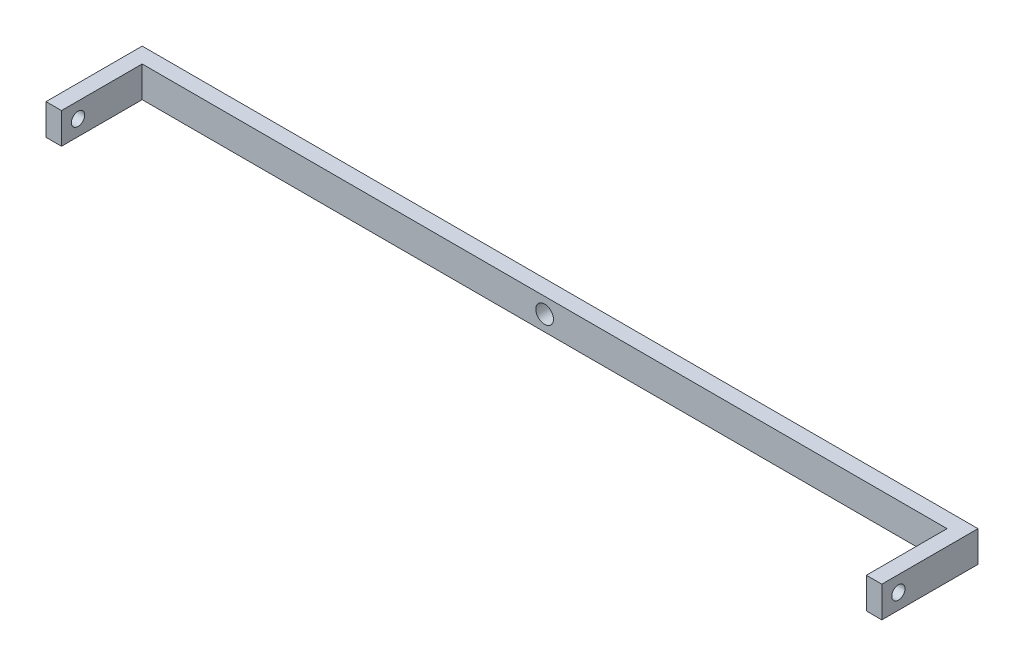
ISO-10303-21;
HEADER;
FILE_DESCRIPTION(('STEP AP214'),'2;1');
FILE_NAME('part.step','',(''),(''),'','','');
FILE_SCHEMA(('AUTOMOTIVE_DESIGN { 1 0 10303 214 1 1 1 1 }'));
ENDSEC;
DATA;
#1=APPLICATION_CONTEXT('core data for automotive mechanical design processes');
#2=APPLICATION_PROTOCOL_DEFINITION('international standard','automotive_design',2000,#1);
#3=PRODUCT_CONTEXT('',#1,'mechanical');
#4=PRODUCT('Part','Part','',(#3));
#5=PRODUCT_RELATED_PRODUCT_CATEGORY('part','',(#4));
#6=PRODUCT_DEFINITION_FORMATION('','',#4);
#7=PRODUCT_DEFINITION_CONTEXT('part definition',#1,'design');
#8=PRODUCT_DEFINITION('design','',#6,#7);
#9=PRODUCT_DEFINITION_SHAPE('','',#8);
#10=(LENGTH_UNIT() NAMED_UNIT(*) SI_UNIT(.MILLI.,.METRE.));
#11=(NAMED_UNIT(*) PLANE_ANGLE_UNIT() SI_UNIT($,.RADIAN.));
#12=(NAMED_UNIT(*) SI_UNIT($,.STERADIAN.) SOLID_ANGLE_UNIT());
#13=UNCERTAINTY_MEASURE_WITH_UNIT(LENGTH_MEASURE(1.E-05),#10,'distance_accuracy_value','');
#14=(GEOMETRIC_REPRESENTATION_CONTEXT(3) GLOBAL_UNCERTAINTY_ASSIGNED_CONTEXT((#13)) GLOBAL_UNIT_ASSIGNED_CONTEXT((#10,
#11,#12)) REPRESENTATION_CONTEXT('',''));
#15=CARTESIAN_POINT('',(0.,0.,0.));
#16=DIRECTION('',(0.,0.,1.));
#17=DIRECTION('',(1.,0.,0.));
#18=AXIS2_PLACEMENT_3D('',#15,#16,#17);
#19=CARTESIAN_POINT('',(94.5,3.5,-1.75));
#20=DIRECTION('',(0.,0.,1.));
#21=DIRECTION('',(1.,0.,0.));
#22=AXIS2_PLACEMENT_3D('',#19,#20,#21);
#23=PLANE('',#22);
#24=CARTESIAN_POINT('',(0.,0.,-1.74999999999999));
#25=DIRECTION('',(0.,0.,-1.));
#26=DIRECTION('',(-1.,0.,0.));
#27=AXIS2_PLACEMENT_3D('',#24,#25,#26);
#28=CIRCLE('',#27,2.);
#29=CARTESIAN_POINT('',(-2.,0.,-1.74999999999999));
#30=VERTEX_POINT('',#29);
#31=EDGE_CURVE('E179',#30,#30,#28,.T.);
#32=ORIENTED_EDGE('',*,*,#31,.F.);
#33=EDGE_LOOP('',(#32));
#34=FACE_BOUND('',#33,.T.);
#35=DIRECTION('',(-1.,0.,0.));
#36=VECTOR('',#35,1.);
#37=CARTESIAN_POINT('',(94.5,-3.5,-1.75));
#38=LINE('',#37,#36);
#39=CARTESIAN_POINT('',(94.5,-3.5,-1.75));
#40=VERTEX_POINT('',#39);
#41=CARTESIAN_POINT('',(-94.5,-3.5,-1.74999999999998));
#42=VERTEX_POINT('',#41);
#43=EDGE_CURVE('E131',#40,#42,#38,.T.);
#44=ORIENTED_EDGE('',*,*,#43,.T.);
#45=DIRECTION('',(0.,-1.,0.));
#46=VECTOR('',#45,1.);
#47=CARTESIAN_POINT('',(-94.5,3.5,-1.74999999999998));
#48=LINE('',#47,#46);
#49=CARTESIAN_POINT('',(-94.5,3.5,-1.74999999999998));
#50=VERTEX_POINT('',#49);
#51=EDGE_CURVE('E11',#50,#42,#48,.T.);
#52=ORIENTED_EDGE('',*,*,#51,.F.);
#53=DIRECTION('',(-1.,0.,0.));
#54=VECTOR('',#53,1.);
#55=CARTESIAN_POINT('',(94.5,3.5,-1.75));
#56=LINE('',#55,#54);
#57=CARTESIAN_POINT('',(94.5,3.5,-1.75));
#58=VERTEX_POINT('',#57);
#59=EDGE_CURVE('E145',#58,#50,#56,.T.);
#60=ORIENTED_EDGE('',*,*,#59,.F.);
#61=DIRECTION('',(0.,-1.,0.));
#62=VECTOR('',#61,1.);
#63=CARTESIAN_POINT('',(94.5,3.5,-1.75));
#64=LINE('',#63,#62);
#65=EDGE_CURVE('E127',#58,#40,#64,.T.);
#66=ORIENTED_EDGE('',*,*,#65,.T.);
#67=EDGE_LOOP('',(#44,#52,#60,#66));
#68=FACE_BOUND('',#67,.T.);
#69=ADVANCED_FACE('F34',(#34,#68),#23,.F.);
#70=CARTESIAN_POINT('',(-94.5,3.5,-1.74999999999998));
#71=DIRECTION('',(1.,0.,0.));
#72=DIRECTION('',(0.,0.,-1.));
#73=AXIS2_PLACEMENT_3D('',#70,#71,#72);
#74=PLANE('',#73);
#75=CARTESIAN_POINT('',(-94.5,0.,16.25));
#76=DIRECTION('',(1.,0.,0.));
#77=DIRECTION('',(0.,0.,-1.));
#78=AXIS2_PLACEMENT_3D('',#75,#76,#77);
#79=CIRCLE('',#78,1.5);
#80=CARTESIAN_POINT('',(-94.5,0.,14.75));
#81=VERTEX_POINT('',#80);
#82=EDGE_CURVE('E182',#81,#81,#79,.T.);
#83=ORIENTED_EDGE('',*,*,#82,.T.);
#84=EDGE_LOOP('',(#83));
#85=FACE_BOUND('',#84,.T.);
#86=DIRECTION('',(0.,0.,1.));
#87=VECTOR('',#86,1.);
#88=CARTESIAN_POINT('',(-94.5,-3.5,-1.74999999999998));
#89=LINE('',#88,#87);
#90=CARTESIAN_POINT('',(-94.5,-3.5,20.));
#91=VERTEX_POINT('',#90);
#92=EDGE_CURVE('E134',#42,#91,#89,.T.);
#93=ORIENTED_EDGE('',*,*,#92,.T.);
#94=DIRECTION('',(0.,-1.,0.));
#95=VECTOR('',#94,1.);
#96=CARTESIAN_POINT('',(-94.5,3.5,20.));
#97=LINE('',#96,#95);
#98=CARTESIAN_POINT('',(-94.5,3.5,20.));
#99=VERTEX_POINT('',#98);
#100=EDGE_CURVE('E43',#99,#91,#97,.T.);
#101=ORIENTED_EDGE('',*,*,#100,.F.);
#102=DIRECTION('',(0.,0.,1.));
#103=VECTOR('',#102,1.);
#104=CARTESIAN_POINT('',(-94.5,3.5,-1.74999999999998));
#105=LINE('',#104,#103);
#106=EDGE_CURVE('E94',#50,#99,#105,.T.);
#107=ORIENTED_EDGE('',*,*,#106,.F.);
#108=ORIENTED_EDGE('',*,*,#51,.T.);
#109=EDGE_LOOP('',(#93,#101,#107,#108));
#110=FACE_BOUND('',#109,.T.);
#111=ADVANCED_FACE('F215',(#85,#110),#74,.F.);
#112=CARTESIAN_POINT('',(-94.5,3.5,20.));
#113=DIRECTION('',(0.,0.,-1.));
#114=DIRECTION('',(-1.,0.,0.));
#115=AXIS2_PLACEMENT_3D('',#112,#113,#114);
#116=PLANE('',#115);
#117=DIRECTION('',(1.,0.,0.));
#118=VECTOR('',#117,1.);
#119=CARTESIAN_POINT('',(-94.5,-3.5,20.));
#120=LINE('',#119,#118);
#121=CARTESIAN_POINT('',(-91.,-3.5,20.));
#122=VERTEX_POINT('',#121);
#123=EDGE_CURVE('E136',#91,#122,#120,.T.);
#124=ORIENTED_EDGE('',*,*,#123,.T.);
#125=DIRECTION('',(0.,-1.,0.));
#126=VECTOR('',#125,1.);
#127=CARTESIAN_POINT('',(-91.,3.5,20.));
#128=LINE('',#127,#126);
#129=CARTESIAN_POINT('',(-91.,3.5,20.));
#130=VERTEX_POINT('',#129);
#131=EDGE_CURVE('E152',#130,#122,#128,.T.);
#132=ORIENTED_EDGE('',*,*,#131,.F.);
#133=DIRECTION('',(1.,0.,0.));
#134=VECTOR('',#133,1.);
#135=CARTESIAN_POINT('',(-94.5,3.5,20.));
#136=LINE('',#135,#134);
#137=EDGE_CURVE('E161',#99,#130,#136,.T.);
#138=ORIENTED_EDGE('',*,*,#137,.F.);
#139=ORIENTED_EDGE('',*,*,#100,.T.);
#140=EDGE_LOOP('',(#124,#132,#138,#139));
#141=FACE_BOUND('',#140,.T.);
#142=ADVANCED_FACE('F159',(#141),#116,.F.);
#143=CARTESIAN_POINT('',(-91.,3.5,1.75000000000002));
#144=DIRECTION('',(-1.,0.,0.));
#145=DIRECTION('',(0.,0.,1.));
#146=AXIS2_PLACEMENT_3D('',#143,#144,#145);
#147=PLANE('',#146);
#148=CARTESIAN_POINT('',(-91.,0.,16.25));
#149=DIRECTION('',(-1.,0.,0.));
#150=DIRECTION('',(0.,0.,1.));
#151=AXIS2_PLACEMENT_3D('',#148,#149,#150);
#152=CIRCLE('',#151,1.5);
#153=CARTESIAN_POINT('',(-91.,0.,17.75));
#154=VERTEX_POINT('',#153);
#155=EDGE_CURVE('E185',#154,#154,#152,.T.);
#156=ORIENTED_EDGE('',*,*,#155,.T.);
#157=EDGE_LOOP('',(#156));
#158=FACE_BOUND('',#157,.T.);
#159=DIRECTION('',(0.,0.,-1.));
#160=VECTOR('',#159,1.);
#161=CARTESIAN_POINT('',(-91.,-3.5,1.75000000000002));
#162=LINE('',#161,#160);
#163=CARTESIAN_POINT('',(-91.,-3.5,1.75000000000002));
#164=VERTEX_POINT('',#163);
#165=EDGE_CURVE('E138',#122,#164,#162,.T.);
#166=ORIENTED_EDGE('',*,*,#165,.T.);
#167=DIRECTION('',(0.,-1.,0.));
#168=VECTOR('',#167,1.);
#169=CARTESIAN_POINT('',(-91.,3.5,1.75000000000002));
#170=LINE('',#169,#168);
#171=CARTESIAN_POINT('',(-91.,3.5,1.75000000000002));
#172=VERTEX_POINT('',#171);
#173=EDGE_CURVE('E149',#172,#164,#170,.T.);
#174=ORIENTED_EDGE('',*,*,#173,.F.);
#175=DIRECTION('',(0.,0.,-1.));
#176=VECTOR('',#175,1.);
#177=CARTESIAN_POINT('',(-91.,3.5,1.75000000000002));
#178=LINE('',#177,#176);
#179=EDGE_CURVE('E173',#130,#172,#178,.T.);
#180=ORIENTED_EDGE('',*,*,#179,.F.);
#181=ORIENTED_EDGE('',*,*,#131,.T.);
#182=EDGE_LOOP('',(#166,#174,#180,#181));
#183=FACE_BOUND('',#182,.T.);
#184=ADVANCED_FACE('F169',(#158,#183),#147,.F.);
#185=CARTESIAN_POINT('',(91.,3.5,1.75));
#186=DIRECTION('',(0.,0.,-1.));
#187=DIRECTION('',(-1.,0.,0.));
#188=AXIS2_PLACEMENT_3D('',#185,#186,#187);
#189=PLANE('',#188);
#190=CARTESIAN_POINT('',(0.,0.,1.75000000000001));
#191=DIRECTION('',(0.,0.,-1.));
#192=DIRECTION('',(-1.,0.,0.));
#193=AXIS2_PLACEMENT_3D('',#190,#191,#192);
#194=CIRCLE('',#193,2.);
#195=CARTESIAN_POINT('',(-2.,0.,1.75000000000001));
#196=VERTEX_POINT('',#195);
#197=EDGE_CURVE('E37',#196,#196,#194,.T.);
#198=ORIENTED_EDGE('',*,*,#197,.T.);
#199=EDGE_LOOP('',(#198));
#200=FACE_BOUND('',#199,.T.);
#201=DIRECTION('',(1.,0.,0.));
#202=VECTOR('',#201,1.);
#203=CARTESIAN_POINT('',(91.,-3.5,1.75));
#204=LINE('',#203,#202);
#205=CARTESIAN_POINT('',(91.,-3.5,1.75));
#206=VERTEX_POINT('',#205);
#207=EDGE_CURVE('E140',#164,#206,#204,.T.);
#208=ORIENTED_EDGE('',*,*,#207,.T.);
#209=DIRECTION('',(0.,-1.,0.));
#210=VECTOR('',#209,1.);
#211=CARTESIAN_POINT('',(91.,3.5,1.75));
#212=LINE('',#211,#210);
#213=CARTESIAN_POINT('',(91.,3.5,1.75));
#214=VERTEX_POINT('',#213);
#215=EDGE_CURVE('E122',#214,#206,#212,.T.);
#216=ORIENTED_EDGE('',*,*,#215,.F.);
#217=DIRECTION('',(1.,0.,0.));
#218=VECTOR('',#217,1.);
#219=CARTESIAN_POINT('',(91.,3.5,1.75));
#220=LINE('',#219,#218);
#221=EDGE_CURVE('E113',#172,#214,#220,.T.);
#222=ORIENTED_EDGE('',*,*,#221,.F.);
#223=ORIENTED_EDGE('',*,*,#173,.T.);
#224=EDGE_LOOP('',(#208,#216,#222,#223));
#225=FACE_BOUND('',#224,.T.);
#226=ADVANCED_FACE('F172',(#200,#225),#189,.F.);
#227=CARTESIAN_POINT('',(91.,3.5,1.75));
#228=DIRECTION('',(1.,0.,0.));
#229=DIRECTION('',(0.,0.,-1.));
#230=AXIS2_PLACEMENT_3D('',#227,#228,#229);
#231=PLANE('',#230);
#232=CARTESIAN_POINT('',(91.,0.,16.25));
#233=DIRECTION('',(1.,0.,0.));
#234=DIRECTION('',(0.,0.,-1.));
#235=AXIS2_PLACEMENT_3D('',#232,#233,#234);
#236=CIRCLE('',#235,1.5);
#237=CARTESIAN_POINT('',(91.,0.,14.75));
#238=VERTEX_POINT('',#237);
#239=EDGE_CURVE('E188',#238,#238,#236,.T.);
#240=ORIENTED_EDGE('',*,*,#239,.T.);
#241=EDGE_LOOP('',(#240));
#242=FACE_BOUND('',#241,.T.);
#243=DIRECTION('',(0.,0.,1.));
#244=VECTOR('',#243,1.);
#245=CARTESIAN_POINT('',(91.,-3.5,1.75));
#246=LINE('',#245,#244);
#247=CARTESIAN_POINT('',(91.,-3.5,20.));
#248=VERTEX_POINT('',#247);
#249=EDGE_CURVE('E121',#206,#248,#246,.T.);
#250=ORIENTED_EDGE('',*,*,#249,.T.);
#251=DIRECTION('',(0.,-1.,0.));
#252=VECTOR('',#251,1.);
#253=CARTESIAN_POINT('',(91.,3.5,20.));
#254=LINE('',#253,#252);
#255=CARTESIAN_POINT('',(91.,3.5,20.));
#256=VERTEX_POINT('',#255);
#257=EDGE_CURVE('E118',#256,#248,#254,.T.);
#258=ORIENTED_EDGE('',*,*,#257,.F.);
#259=DIRECTION('',(0.,0.,1.));
#260=VECTOR('',#259,1.);
#261=CARTESIAN_POINT('',(91.,3.5,1.75));
#262=LINE('',#261,#260);
#263=EDGE_CURVE('E107',#214,#256,#262,.T.);
#264=ORIENTED_EDGE('',*,*,#263,.F.);
#265=ORIENTED_EDGE('',*,*,#215,.T.);
#266=EDGE_LOOP('',(#250,#258,#264,#265));
#267=FACE_BOUND('',#266,.T.);
#268=ADVANCED_FACE('F119',(#242,#267),#231,.F.);
#269=CARTESIAN_POINT('',(91.,3.5,20.));
#270=DIRECTION('',(0.,0.,-1.));
#271=DIRECTION('',(-1.,0.,0.));
#272=AXIS2_PLACEMENT_3D('',#269,#270,#271);
#273=PLANE('',#272);
#274=DIRECTION('',(1.,0.,0.));
#275=VECTOR('',#274,1.);
#276=CARTESIAN_POINT('',(91.,-3.5,20.));
#277=LINE('',#276,#275);
#278=CARTESIAN_POINT('',(94.5,-3.5,20.));
#279=VERTEX_POINT('',#278);
#280=EDGE_CURVE('E80',#248,#279,#277,.T.);
#281=ORIENTED_EDGE('',*,*,#280,.T.);
#282=DIRECTION('',(0.,-1.,0.));
#283=VECTOR('',#282,1.);
#284=CARTESIAN_POINT('',(94.5,3.5,20.));
#285=LINE('',#284,#283);
#286=CARTESIAN_POINT('',(94.5,3.5,20.));
#287=VERTEX_POINT('',#286);
#288=EDGE_CURVE('E123',#287,#279,#285,.T.);
#289=ORIENTED_EDGE('',*,*,#288,.F.);
#290=DIRECTION('',(1.,0.,0.));
#291=VECTOR('',#290,1.);
#292=CARTESIAN_POINT('',(91.,3.5,20.));
#293=LINE('',#292,#291);
#294=EDGE_CURVE('E111',#256,#287,#293,.T.);
#295=ORIENTED_EDGE('',*,*,#294,.F.);
#296=ORIENTED_EDGE('',*,*,#257,.T.);
#297=EDGE_LOOP('',(#281,#289,#295,#296));
#298=FACE_BOUND('',#297,.T.);
#299=ADVANCED_FACE('F125',(#298),#273,.F.);
#300=CARTESIAN_POINT('',(94.5,3.5,-1.75));
#301=DIRECTION('',(-1.,0.,0.));
#302=DIRECTION('',(0.,0.,1.));
#303=AXIS2_PLACEMENT_3D('',#300,#301,#302);
#304=PLANE('',#303);
#305=CARTESIAN_POINT('',(94.5,0.,16.25));
#306=DIRECTION('',(-1.,0.,0.));
#307=DIRECTION('',(0.,0.,1.));
#308=AXIS2_PLACEMENT_3D('',#305,#306,#307);
#309=CIRCLE('',#308,1.5);
#310=CARTESIAN_POINT('',(94.5,0.,17.75));
#311=VERTEX_POINT('',#310);
#312=EDGE_CURVE('E191',#311,#311,#309,.T.);
#313=ORIENTED_EDGE('',*,*,#312,.T.);
#314=EDGE_LOOP('',(#313));
#315=FACE_BOUND('',#314,.T.);
#316=DIRECTION('',(0.,0.,-1.));
#317=VECTOR('',#316,1.);
#318=CARTESIAN_POINT('',(94.5,-3.5,-1.75));
#319=LINE('',#318,#317);
#320=EDGE_CURVE('E86',#279,#40,#319,.T.);
#321=ORIENTED_EDGE('',*,*,#320,.T.);
#322=ORIENTED_EDGE('',*,*,#65,.F.);
#323=DIRECTION('',(0.,0.,-1.));
#324=VECTOR('',#323,1.);
#325=CARTESIAN_POINT('',(94.5,3.5,-1.75));
#326=LINE('',#325,#324);
#327=EDGE_CURVE('E51',#287,#58,#326,.T.);
#328=ORIENTED_EDGE('',*,*,#327,.F.);
#329=ORIENTED_EDGE('',*,*,#288,.T.);
#330=EDGE_LOOP('',(#321,#322,#328,#329));
#331=FACE_BOUND('',#330,.T.);
#332=ADVANCED_FACE('F195',(#315,#331),#304,.F.);
#333=CARTESIAN_POINT('',(0.,3.5,0.));
#334=DIRECTION('',(0.,1.,0.));
#335=DIRECTION('',(0.,0.,1.));
#336=AXIS2_PLACEMENT_3D('',#333,#334,#335);
#337=PLANE('',#336);
#338=ORIENTED_EDGE('',*,*,#59,.T.);
#339=ORIENTED_EDGE('',*,*,#106,.T.);
#340=ORIENTED_EDGE('',*,*,#137,.T.);
#341=ORIENTED_EDGE('',*,*,#179,.T.);
#342=ORIENTED_EDGE('',*,*,#221,.T.);
#343=ORIENTED_EDGE('',*,*,#263,.T.);
#344=ORIENTED_EDGE('',*,*,#294,.T.);
#345=ORIENTED_EDGE('',*,*,#327,.T.);
#346=EDGE_LOOP('',(#338,#339,#340,#341,#342,#343,#344,#345));
#347=FACE_BOUND('',#346,.T.);
#348=ADVANCED_FACE('F109',(#347),#337,.T.);
#349=CARTESIAN_POINT('',(0.,-3.5,0.));
#350=DIRECTION('',(0.,1.,0.));
#351=DIRECTION('',(0.,0.,1.));
#352=AXIS2_PLACEMENT_3D('',#349,#350,#351);
#353=PLANE('',#352);
#354=ORIENTED_EDGE('',*,*,#43,.F.);
#355=ORIENTED_EDGE('',*,*,#320,.F.);
#356=ORIENTED_EDGE('',*,*,#280,.F.);
#357=ORIENTED_EDGE('',*,*,#249,.F.);
#358=ORIENTED_EDGE('',*,*,#207,.F.);
#359=ORIENTED_EDGE('',*,*,#165,.F.);
#360=ORIENTED_EDGE('',*,*,#123,.F.);
#361=ORIENTED_EDGE('',*,*,#92,.F.);
#362=EDGE_LOOP('',(#354,#355,#356,#357,#358,#359,#360,#361));
#363=FACE_BOUND('',#362,.T.);
#364=ADVANCED_FACE('F165',(#363),#353,.F.);
#365=CARTESIAN_POINT('',(0.,0.,5.25000000000001));
#366=DIRECTION('',(0.,0.,-1.));
#367=DIRECTION('',(-1.,0.,0.));
#368=AXIS2_PLACEMENT_3D('',#365,#366,#367);
#369=CYLINDRICAL_SURFACE('',#368,2.);
#370=ORIENTED_EDGE('',*,*,#31,.T.);
#371=EDGE_LOOP('',(#370));
#372=FACE_BOUND('',#371,.T.);
#373=ORIENTED_EDGE('',*,*,#197,.F.);
#374=EDGE_LOOP('',(#373));
#375=FACE_BOUND('',#374,.T.);
#376=ADVANCED_FACE('F201',(#372,#375),#369,.F.);
#377=CARTESIAN_POINT('',(94.5,0.,16.25));
#378=DIRECTION('',(-1.,0.,0.));
#379=DIRECTION('',(0.,0.,1.));
#380=AXIS2_PLACEMENT_3D('',#377,#378,#379);
#381=CYLINDRICAL_SURFACE('',#380,1.5);
#382=ORIENTED_EDGE('',*,*,#312,.F.);
#383=EDGE_LOOP('',(#382));
#384=FACE_BOUND('',#383,.T.);
#385=ORIENTED_EDGE('',*,*,#239,.F.);
#386=EDGE_LOOP('',(#385));
#387=FACE_BOUND('',#386,.T.);
#388=ADVANCED_FACE('F197',(#384,#387),#381,.F.);
#389=ORIENTED_EDGE('',*,*,#155,.F.);
#390=EDGE_LOOP('',(#389));
#391=FACE_BOUND('',#390,.T.);
#392=ORIENTED_EDGE('',*,*,#82,.F.);
#393=EDGE_LOOP('',(#392));
#394=FACE_BOUND('',#393,.T.);
#395=ADVANCED_FACE('F200',(#391,#394),#381,.F.);
#396=CLOSED_SHELL('',(#69,#111,#142,#184,#226,#268,#299,#332,#348,#364,#376,#388,#395));
#397=MANIFOLD_SOLID_BREP('B2',#396);
#398=ADVANCED_BREP_SHAPE_REPRESENTATION('',(#18,#397),#14);
#399=SHAPE_DEFINITION_REPRESENTATION(#9,#398);
ENDSEC;
END-ISO-10303-21;
